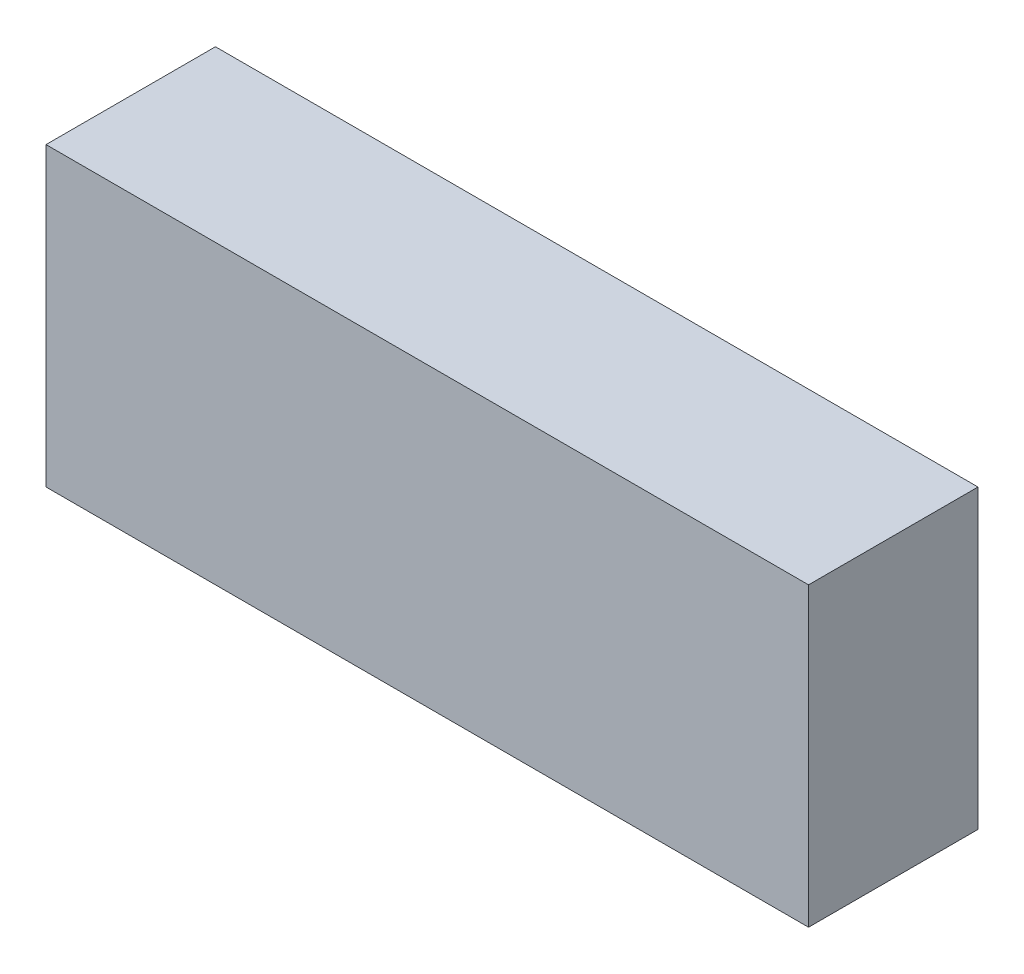
ISO-10303-21;
HEADER;
FILE_DESCRIPTION(('STEP AP214'),'2;1');
FILE_NAME('part.step','',(''),(''),'','','');
FILE_SCHEMA(('AUTOMOTIVE_DESIGN { 1 0 10303 214 1 1 1 1 }'));
ENDSEC;
DATA;
#1=APPLICATION_CONTEXT('core data for automotive mechanical design processes');
#2=APPLICATION_PROTOCOL_DEFINITION('international standard','automotive_design',2000,#1);
#3=PRODUCT_CONTEXT('',#1,'mechanical');
#4=PRODUCT('Part','Part','',(#3));
#5=PRODUCT_RELATED_PRODUCT_CATEGORY('part','',(#4));
#6=PRODUCT_DEFINITION_FORMATION('','',#4);
#7=PRODUCT_DEFINITION_CONTEXT('part definition',#1,'design');
#8=PRODUCT_DEFINITION('design','',#6,#7);
#9=PRODUCT_DEFINITION_SHAPE('','',#8);
#10=(LENGTH_UNIT() NAMED_UNIT(*) SI_UNIT(.MILLI.,.METRE.));
#11=(NAMED_UNIT(*) PLANE_ANGLE_UNIT() SI_UNIT($,.RADIAN.));
#12=(NAMED_UNIT(*) SI_UNIT($,.STERADIAN.) SOLID_ANGLE_UNIT());
#13=UNCERTAINTY_MEASURE_WITH_UNIT(LENGTH_MEASURE(1.E-05),#10,'distance_accuracy_value','');
#14=(GEOMETRIC_REPRESENTATION_CONTEXT(3) GLOBAL_UNCERTAINTY_ASSIGNED_CONTEXT((#13)) GLOBAL_UNIT_ASSIGNED_CONTEXT((#10,
#11,#12)) REPRESENTATION_CONTEXT('',''));
#15=CARTESIAN_POINT('',(0.,0.,0.));
#16=DIRECTION('',(0.,0.,1.));
#17=DIRECTION('',(1.,0.,0.));
#18=AXIS2_PLACEMENT_3D('',#15,#16,#17);
#19=CARTESIAN_POINT('',(0.,0.,20.));
#20=DIRECTION('',(-1.,0.,0.));
#21=DIRECTION('',(0.,0.,1.));
#22=AXIS2_PLACEMENT_3D('',#19,#20,#21);
#23=PLANE('',#22);
#24=DIRECTION('',(0.,1.,0.));
#25=VECTOR('',#24,1.);
#26=CARTESIAN_POINT('',(0.,0.,0.));
#27=LINE('',#26,#25);
#28=CARTESIAN_POINT('',(0.,0.,0.));
#29=VERTEX_POINT('',#28);
#30=CARTESIAN_POINT('',(0.,35.,0.));
#31=VERTEX_POINT('',#30);
#32=EDGE_CURVE('E96',#29,#31,#27,.T.);
#33=ORIENTED_EDGE('',*,*,#32,.T.);
#34=DIRECTION('',(0.,0.,-1.));
#35=VECTOR('',#34,1.);
#36=CARTESIAN_POINT('',(0.,35.,20.));
#37=LINE('',#36,#35);
#38=CARTESIAN_POINT('',(0.,35.,20.));
#39=VERTEX_POINT('',#38);
#40=EDGE_CURVE('E11',#39,#31,#37,.T.);
#41=ORIENTED_EDGE('',*,*,#40,.F.);
#42=DIRECTION('',(0.,1.,0.));
#43=VECTOR('',#42,1.);
#44=CARTESIAN_POINT('',(0.,0.,20.));
#45=LINE('',#44,#43);
#46=CARTESIAN_POINT('',(0.,0.,20.));
#47=VERTEX_POINT('',#46);
#48=EDGE_CURVE('E84',#47,#39,#45,.T.);
#49=ORIENTED_EDGE('',*,*,#48,.F.);
#50=DIRECTION('',(0.,0.,-1.));
#51=VECTOR('',#50,1.);
#52=CARTESIAN_POINT('',(0.,0.,20.));
#53=LINE('',#52,#51);
#54=EDGE_CURVE('E92',#47,#29,#53,.T.);
#55=ORIENTED_EDGE('',*,*,#54,.T.);
#56=EDGE_LOOP('',(#33,#41,#49,#55));
#57=FACE_BOUND('',#56,.T.);
#58=ADVANCED_FACE('F33',(#57),#23,.F.);
#59=CARTESIAN_POINT('',(0.,35.,20.));
#60=DIRECTION('',(0.,-1.,0.));
#61=DIRECTION('',(1.,0.,0.));
#62=AXIS2_PLACEMENT_3D('',#59,#60,#61);
#63=PLANE('',#62);
#64=DIRECTION('',(-1.,0.,0.));
#65=VECTOR('',#64,1.);
#66=CARTESIAN_POINT('',(0.,35.,0.));
#67=LINE('',#66,#65);
#68=CARTESIAN_POINT('',(-90.,35.,0.));
#69=VERTEX_POINT('',#68);
#70=EDGE_CURVE('E88',#31,#69,#67,.T.);
#71=ORIENTED_EDGE('',*,*,#70,.T.);
#72=DIRECTION('',(0.,0.,-1.));
#73=VECTOR('',#72,1.);
#74=CARTESIAN_POINT('',(-90.,35.,20.));
#75=LINE('',#74,#73);
#76=CARTESIAN_POINT('',(-90.,35.,20.));
#77=VERTEX_POINT('',#76);
#78=EDGE_CURVE('E41',#77,#69,#75,.T.);
#79=ORIENTED_EDGE('',*,*,#78,.F.);
#80=DIRECTION('',(-1.,0.,0.));
#81=VECTOR('',#80,1.);
#82=CARTESIAN_POINT('',(0.,35.,20.));
#83=LINE('',#82,#81);
#84=EDGE_CURVE('E79',#39,#77,#83,.T.);
#85=ORIENTED_EDGE('',*,*,#84,.F.);
#86=ORIENTED_EDGE('',*,*,#40,.T.);
#87=EDGE_LOOP('',(#71,#79,#85,#86));
#88=FACE_BOUND('',#87,.T.);
#89=ADVANCED_FACE('F87',(#88),#63,.F.);
#90=CARTESIAN_POINT('',(-90.,0.,20.));
#91=DIRECTION('',(1.,0.,0.));
#92=DIRECTION('',(0.,0.,-1.));
#93=AXIS2_PLACEMENT_3D('',#90,#91,#92);
#94=PLANE('',#93);
#95=DIRECTION('',(0.,-1.,0.));
#96=VECTOR('',#95,1.);
#97=CARTESIAN_POINT('',(-90.,0.,0.));
#98=LINE('',#97,#96);
#99=CARTESIAN_POINT('',(-90.,0.,0.));
#100=VERTEX_POINT('',#99);
#101=EDGE_CURVE('E66',#69,#100,#98,.T.);
#102=ORIENTED_EDGE('',*,*,#101,.T.);
#103=DIRECTION('',(0.,0.,-1.));
#104=VECTOR('',#103,1.);
#105=CARTESIAN_POINT('',(-90.,0.,20.));
#106=LINE('',#105,#104);
#107=CARTESIAN_POINT('',(-90.,0.,20.));
#108=VERTEX_POINT('',#107);
#109=EDGE_CURVE('E89',#108,#100,#106,.T.);
#110=ORIENTED_EDGE('',*,*,#109,.F.);
#111=DIRECTION('',(0.,-1.,0.));
#112=VECTOR('',#111,1.);
#113=CARTESIAN_POINT('',(-90.,0.,20.));
#114=LINE('',#113,#112);
#115=EDGE_CURVE('E82',#77,#108,#114,.T.);
#116=ORIENTED_EDGE('',*,*,#115,.F.);
#117=ORIENTED_EDGE('',*,*,#78,.T.);
#118=EDGE_LOOP('',(#102,#110,#116,#117));
#119=FACE_BOUND('',#118,.T.);
#120=ADVANCED_FACE('F90',(#119),#94,.F.);
#121=CARTESIAN_POINT('',(0.,0.,20.));
#122=DIRECTION('',(0.,1.,0.));
#123=DIRECTION('',(-1.,0.,0.));
#124=AXIS2_PLACEMENT_3D('',#121,#122,#123);
#125=PLANE('',#124);
#126=DIRECTION('',(1.,0.,0.));
#127=VECTOR('',#126,1.);
#128=CARTESIAN_POINT('',(0.,0.,0.));
#129=LINE('',#128,#127);
#130=EDGE_CURVE('E72',#100,#29,#129,.T.);
#131=ORIENTED_EDGE('',*,*,#130,.T.);
#132=ORIENTED_EDGE('',*,*,#54,.F.);
#133=DIRECTION('',(1.,0.,0.));
#134=VECTOR('',#133,1.);
#135=CARTESIAN_POINT('',(0.,0.,20.));
#136=LINE('',#135,#134);
#137=EDGE_CURVE('E49',#108,#47,#136,.T.);
#138=ORIENTED_EDGE('',*,*,#137,.F.);
#139=ORIENTED_EDGE('',*,*,#109,.T.);
#140=EDGE_LOOP('',(#131,#132,#138,#139));
#141=FACE_BOUND('',#140,.T.);
#142=ADVANCED_FACE('F103',(#141),#125,.F.);
#143=CARTESIAN_POINT('',(0.,0.,20.));
#144=DIRECTION('',(0.,0.,1.));
#145=DIRECTION('',(1.,0.,0.));
#146=AXIS2_PLACEMENT_3D('',#143,#144,#145);
#147=PLANE('',#146);
#148=ORIENTED_EDGE('',*,*,#48,.T.);
#149=ORIENTED_EDGE('',*,*,#84,.T.);
#150=ORIENTED_EDGE('',*,*,#115,.T.);
#151=ORIENTED_EDGE('',*,*,#137,.T.);
#152=EDGE_LOOP('',(#148,#149,#150,#151));
#153=FACE_BOUND('',#152,.T.);
#154=ADVANCED_FACE('F80',(#153),#147,.T.);
#155=CARTESIAN_POINT('',(0.,0.,0.));
#156=DIRECTION('',(0.,0.,1.));
#157=DIRECTION('',(1.,0.,0.));
#158=AXIS2_PLACEMENT_3D('',#155,#156,#157);
#159=PLANE('',#158);
#160=ORIENTED_EDGE('',*,*,#32,.F.);
#161=ORIENTED_EDGE('',*,*,#130,.F.);
#162=ORIENTED_EDGE('',*,*,#101,.F.);
#163=ORIENTED_EDGE('',*,*,#70,.F.);
#164=EDGE_LOOP('',(#160,#161,#162,#163));
#165=FACE_BOUND('',#164,.T.);
#166=ADVANCED_FACE('F106',(#165),#159,.F.);
#167=CLOSED_SHELL('',(#58,#89,#120,#142,#154,#166));
#168=MANIFOLD_SOLID_BREP('B2',#167);
#169=ADVANCED_BREP_SHAPE_REPRESENTATION('',(#18,#168),#14);
#170=SHAPE_DEFINITION_REPRESENTATION(#9,#169);
ENDSEC;
END-ISO-10303-21;
